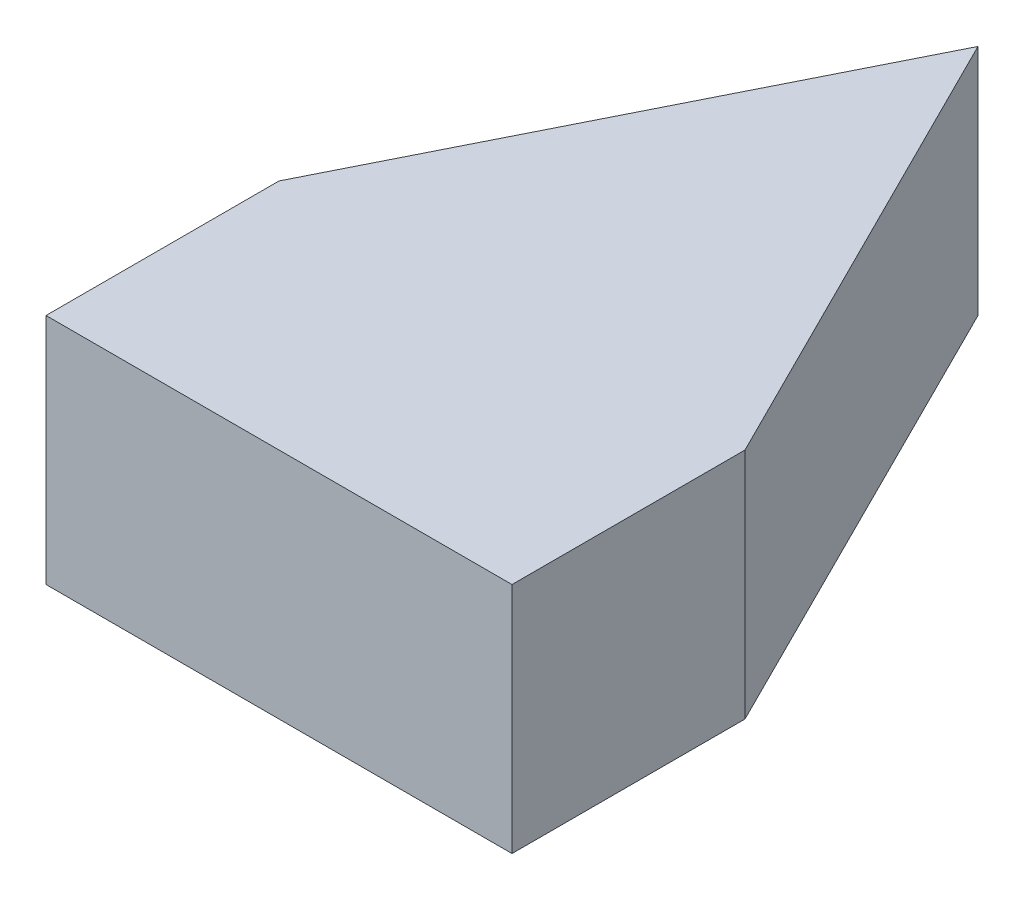
ISO-10303-21;
HEADER;
FILE_DESCRIPTION(('STEP AP214'),'2;1');
FILE_NAME('part.step','',(''),(''),'','','');
FILE_SCHEMA(('AUTOMOTIVE_DESIGN { 1 0 10303 214 1 1 1 1 }'));
ENDSEC;
DATA;
#1=APPLICATION_CONTEXT('core data for automotive mechanical design processes');
#2=APPLICATION_PROTOCOL_DEFINITION('international standard','automotive_design',2000,#1);
#3=PRODUCT_CONTEXT('',#1,'mechanical');
#4=PRODUCT('Part','Part','',(#3));
#5=PRODUCT_RELATED_PRODUCT_CATEGORY('part','',(#4));
#6=PRODUCT_DEFINITION_FORMATION('','',#4);
#7=PRODUCT_DEFINITION_CONTEXT('part definition',#1,'design');
#8=PRODUCT_DEFINITION('design','',#6,#7);
#9=PRODUCT_DEFINITION_SHAPE('','',#8);
#10=(LENGTH_UNIT() NAMED_UNIT(*) SI_UNIT(.MILLI.,.METRE.));
#11=(NAMED_UNIT(*) PLANE_ANGLE_UNIT() SI_UNIT($,.RADIAN.));
#12=(NAMED_UNIT(*) SI_UNIT($,.STERADIAN.) SOLID_ANGLE_UNIT());
#13=UNCERTAINTY_MEASURE_WITH_UNIT(LENGTH_MEASURE(1.E-05),#10,'distance_accuracy_value','');
#14=(GEOMETRIC_REPRESENTATION_CONTEXT(3) GLOBAL_UNCERTAINTY_ASSIGNED_CONTEXT((#13)) GLOBAL_UNIT_ASSIGNED_CONTEXT((#10,
#11,#12)) REPRESENTATION_CONTEXT('',''));
#15=CARTESIAN_POINT('',(0.,0.,0.));
#16=DIRECTION('',(0.,0.,1.));
#17=DIRECTION('',(1.,0.,0.));
#18=AXIS2_PLACEMENT_3D('',#15,#16,#17);
#19=CARTESIAN_POINT('',(0.,3.175,0.));
#20=DIRECTION('',(1.,0.,0.));
#21=DIRECTION('',(0.,0.,-1.));
#22=AXIS2_PLACEMENT_3D('',#19,#20,#21);
#23=PLANE('',#22);
#24=DIRECTION('',(0.,0.,1.));
#25=VECTOR('',#24,1.);
#26=CARTESIAN_POINT('',(0.,0.,0.));
#27=LINE('',#26,#25);
#28=CARTESIAN_POINT('',(0.,0.,0.));
#29=VERTEX_POINT('',#28);
#30=CARTESIAN_POINT('',(0.,0.,3.175));
#31=VERTEX_POINT('',#30);
#32=EDGE_CURVE('E107',#29,#31,#27,.T.);
#33=ORIENTED_EDGE('',*,*,#32,.T.);
#34=DIRECTION('',(0.,-1.,0.));
#35=VECTOR('',#34,1.);
#36=CARTESIAN_POINT('',(0.,3.175,3.175));
#37=LINE('',#36,#35);
#38=CARTESIAN_POINT('',(0.,3.175,3.175));
#39=VERTEX_POINT('',#38);
#40=EDGE_CURVE('E11',#39,#31,#37,.T.);
#41=ORIENTED_EDGE('',*,*,#40,.F.);
#42=DIRECTION('',(0.,0.,1.));
#43=VECTOR('',#42,1.);
#44=CARTESIAN_POINT('',(0.,3.175,0.));
#45=LINE('',#44,#43);
#46=CARTESIAN_POINT('',(0.,3.175,0.));
#47=VERTEX_POINT('',#46);
#48=EDGE_CURVE('E115',#47,#39,#45,.T.);
#49=ORIENTED_EDGE('',*,*,#48,.F.);
#50=DIRECTION('',(0.,-1.,0.));
#51=VECTOR('',#50,1.);
#52=CARTESIAN_POINT('',(0.,3.175,0.));
#53=LINE('',#52,#51);
#54=EDGE_CURVE('E103',#47,#29,#53,.T.);
#55=ORIENTED_EDGE('',*,*,#54,.T.);
#56=EDGE_LOOP('',(#33,#41,#49,#55));
#57=FACE_BOUND('',#56,.T.);
#58=ADVANCED_FACE('F33',(#57),#23,.F.);
#59=CARTESIAN_POINT('',(0.,3.175,3.175));
#60=DIRECTION('',(0.,0.,-1.));
#61=DIRECTION('',(-1.,0.,0.));
#62=AXIS2_PLACEMENT_3D('',#59,#60,#61);
#63=PLANE('',#62);
#64=DIRECTION('',(1.,0.,0.));
#65=VECTOR('',#64,1.);
#66=CARTESIAN_POINT('',(0.,0.,3.175));
#67=LINE('',#66,#65);
#68=CARTESIAN_POINT('',(6.35,0.,3.175));
#69=VERTEX_POINT('',#68);
#70=EDGE_CURVE('E110',#31,#69,#67,.T.);
#71=ORIENTED_EDGE('',*,*,#70,.T.);
#72=DIRECTION('',(0.,-1.,0.));
#73=VECTOR('',#72,1.);
#74=CARTESIAN_POINT('',(6.35,3.175,3.175));
#75=LINE('',#74,#73);
#76=CARTESIAN_POINT('',(6.35,3.175,3.175));
#77=VERTEX_POINT('',#76);
#78=EDGE_CURVE('E41',#77,#69,#75,.T.);
#79=ORIENTED_EDGE('',*,*,#78,.F.);
#80=DIRECTION('',(1.,0.,0.));
#81=VECTOR('',#80,1.);
#82=CARTESIAN_POINT('',(0.,3.175,3.175));
#83=LINE('',#82,#81);
#84=EDGE_CURVE('E83',#39,#77,#83,.T.);
#85=ORIENTED_EDGE('',*,*,#84,.F.);
#86=ORIENTED_EDGE('',*,*,#40,.T.);
#87=EDGE_LOOP('',(#71,#79,#85,#86));
#88=FACE_BOUND('',#87,.T.);
#89=ADVANCED_FACE('F134',(#88),#63,.F.);
#90=CARTESIAN_POINT('',(6.35,3.175,0.));
#91=DIRECTION('',(-1.,0.,0.));
#92=DIRECTION('',(0.,0.,1.));
#93=AXIS2_PLACEMENT_3D('',#90,#91,#92);
#94=PLANE('',#93);
#95=DIRECTION('',(0.,0.,-1.));
#96=VECTOR('',#95,1.);
#97=CARTESIAN_POINT('',(6.35,0.,0.));
#98=LINE('',#97,#96);
#99=CARTESIAN_POINT('',(6.35,0.,0.));
#100=VERTEX_POINT('',#99);
#101=EDGE_CURVE('E98',#69,#100,#98,.T.);
#102=ORIENTED_EDGE('',*,*,#101,.T.);
#103=DIRECTION('',(0.,-1.,0.));
#104=VECTOR('',#103,1.);
#105=CARTESIAN_POINT('',(6.35,3.175,0.));
#106=LINE('',#105,#104);
#107=CARTESIAN_POINT('',(6.35,3.175,0.));
#108=VERTEX_POINT('',#107);
#109=EDGE_CURVE('E95',#108,#100,#106,.T.);
#110=ORIENTED_EDGE('',*,*,#109,.F.);
#111=DIRECTION('',(0.,0.,-1.));
#112=VECTOR('',#111,1.);
#113=CARTESIAN_POINT('',(6.35,3.175,0.));
#114=LINE('',#113,#112);
#115=EDGE_CURVE('E87',#77,#108,#114,.T.);
#116=ORIENTED_EDGE('',*,*,#115,.F.);
#117=ORIENTED_EDGE('',*,*,#78,.T.);
#118=EDGE_LOOP('',(#102,#110,#116,#117));
#119=FACE_BOUND('',#118,.T.);
#120=ADVANCED_FACE('F96',(#119),#94,.F.);
#121=CARTESIAN_POINT('',(6.35,3.175,0.));
#122=DIRECTION('',(-0.894427190999916,0.,0.447213595499958));
#123=DIRECTION('',(0.447213595499958,0.,0.894427190999916));
#124=AXIS2_PLACEMENT_3D('',#121,#122,#123);
#125=PLANE('',#124);
#126=DIRECTION('',(-0.447213595499958,0.,-0.894427190999916));
#127=VECTOR('',#126,1.);
#128=CARTESIAN_POINT('',(6.35,0.,0.));
#129=LINE('',#128,#127);
#130=CARTESIAN_POINT('',(3.175,0.,-6.35));
#131=VERTEX_POINT('',#130);
#132=EDGE_CURVE('E69',#100,#131,#129,.T.);
#133=ORIENTED_EDGE('',*,*,#132,.T.);
#134=DIRECTION('',(0.,-1.,0.));
#135=VECTOR('',#134,1.);
#136=CARTESIAN_POINT('',(3.175,3.175,-6.35));
#137=LINE('',#136,#135);
#138=CARTESIAN_POINT('',(3.175,3.175,-6.35));
#139=VERTEX_POINT('',#138);
#140=EDGE_CURVE('E99',#139,#131,#137,.T.);
#141=ORIENTED_EDGE('',*,*,#140,.F.);
#142=DIRECTION('',(-0.447213595499958,0.,-0.894427190999916));
#143=VECTOR('',#142,1.);
#144=CARTESIAN_POINT('',(6.35,3.175,0.));
#145=LINE('',#144,#143);
#146=EDGE_CURVE('E91',#108,#139,#145,.T.);
#147=ORIENTED_EDGE('',*,*,#146,.F.);
#148=ORIENTED_EDGE('',*,*,#109,.T.);
#149=EDGE_LOOP('',(#133,#141,#147,#148));
#150=FACE_BOUND('',#149,.T.);
#151=ADVANCED_FACE('F101',(#150),#125,.F.);
#152=CARTESIAN_POINT('',(3.175,3.175,-6.35));
#153=DIRECTION('',(0.894427190999916,0.,0.447213595499958));
#154=DIRECTION('',(0.447213595499958,0.,-0.894427190999916));
#155=AXIS2_PLACEMENT_3D('',#152,#153,#154);
#156=PLANE('',#155);
#157=DIRECTION('',(-0.447213595499958,0.,0.894427190999916));
#158=VECTOR('',#157,1.);
#159=CARTESIAN_POINT('',(3.175,0.,-6.35));
#160=LINE('',#159,#158);
#161=EDGE_CURVE('E75',#131,#29,#160,.T.);
#162=ORIENTED_EDGE('',*,*,#161,.T.);
#163=ORIENTED_EDGE('',*,*,#54,.F.);
#164=DIRECTION('',(-0.447213595499958,0.,0.894427190999916));
#165=VECTOR('',#164,1.);
#166=CARTESIAN_POINT('',(3.175,3.175,-6.35));
#167=LINE('',#166,#165);
#168=EDGE_CURVE('E49',#139,#47,#167,.T.);
#169=ORIENTED_EDGE('',*,*,#168,.F.);
#170=ORIENTED_EDGE('',*,*,#140,.T.);
#171=EDGE_LOOP('',(#162,#163,#169,#170));
#172=FACE_BOUND('',#171,.T.);
#173=ADVANCED_FACE('F123',(#172),#156,.F.);
#174=CARTESIAN_POINT('',(0.,3.175,0.));
#175=DIRECTION('',(0.,1.,0.));
#176=DIRECTION('',(0.,0.,1.));
#177=AXIS2_PLACEMENT_3D('',#174,#175,#176);
#178=PLANE('',#177);
#179=ORIENTED_EDGE('',*,*,#48,.T.);
#180=ORIENTED_EDGE('',*,*,#84,.T.);
#181=ORIENTED_EDGE('',*,*,#115,.T.);
#182=ORIENTED_EDGE('',*,*,#146,.T.);
#183=ORIENTED_EDGE('',*,*,#168,.T.);
#184=EDGE_LOOP('',(#179,#180,#181,#182,#183));
#185=FACE_BOUND('',#184,.T.);
#186=ADVANCED_FACE('F89',(#185),#178,.T.);
#187=CARTESIAN_POINT('',(0.,0.,0.));
#188=DIRECTION('',(0.,1.,0.));
#189=DIRECTION('',(0.,0.,1.));
#190=AXIS2_PLACEMENT_3D('',#187,#188,#189);
#191=PLANE('',#190);
#192=ORIENTED_EDGE('',*,*,#32,.F.);
#193=ORIENTED_EDGE('',*,*,#161,.F.);
#194=ORIENTED_EDGE('',*,*,#132,.F.);
#195=ORIENTED_EDGE('',*,*,#101,.F.);
#196=ORIENTED_EDGE('',*,*,#70,.F.);
#197=EDGE_LOOP('',(#192,#193,#194,#195,#196));
#198=FACE_BOUND('',#197,.T.);
#199=ADVANCED_FACE('F119',(#198),#191,.F.);
#200=CLOSED_SHELL('',(#58,#89,#120,#151,#173,#186,#199));
#201=MANIFOLD_SOLID_BREP('B2',#200);
#202=ADVANCED_BREP_SHAPE_REPRESENTATION('',(#18,#201),#14);
#203=SHAPE_DEFINITION_REPRESENTATION(#9,#202);
ENDSEC;
END-ISO-10303-21;
